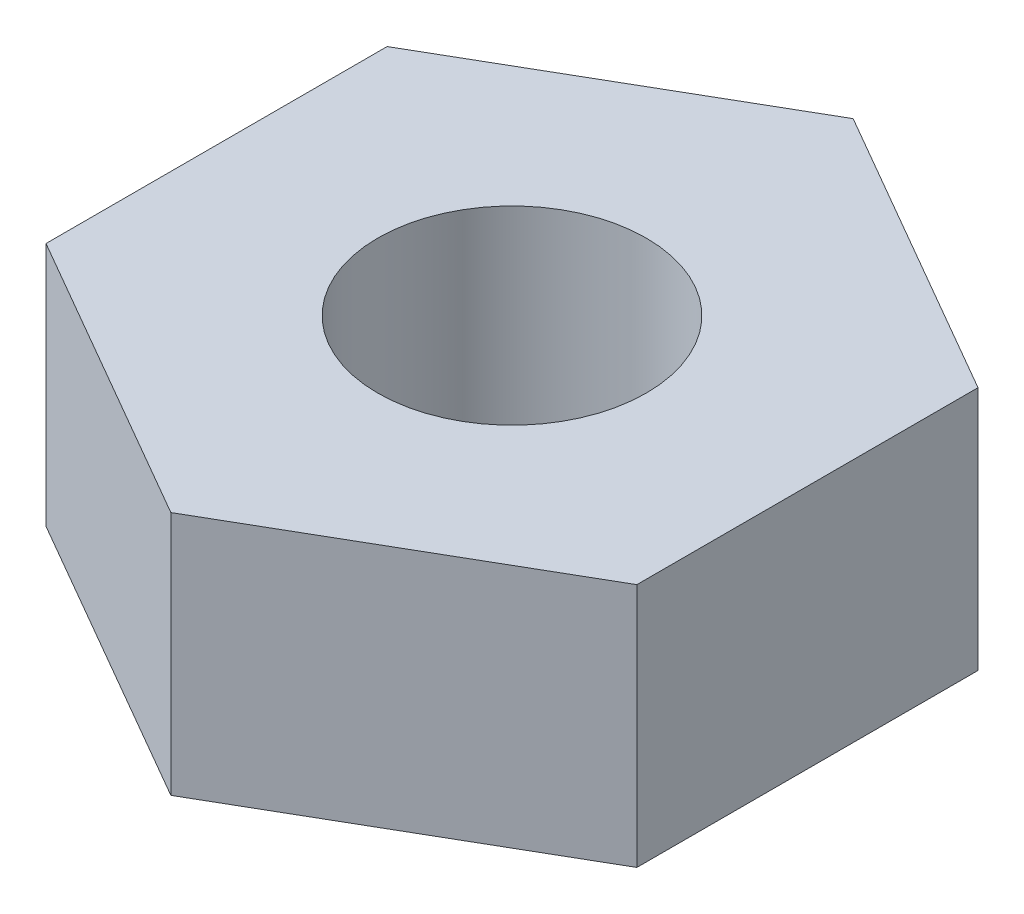
ISO-10303-21;
HEADER;
FILE_DESCRIPTION(('STEP AP214'),'2;1');
FILE_NAME('part.step','',(''),(''),'','','');
FILE_SCHEMA(('AUTOMOTIVE_DESIGN { 1 0 10303 214 1 1 1 1 }'));
ENDSEC;
DATA;
#1=APPLICATION_CONTEXT('core data for automotive mechanical design processes');
#2=APPLICATION_PROTOCOL_DEFINITION('international standard','automotive_design',2000,#1);
#3=PRODUCT_CONTEXT('',#1,'mechanical');
#4=PRODUCT('Part','Part','',(#3));
#5=PRODUCT_RELATED_PRODUCT_CATEGORY('part','',(#4));
#6=PRODUCT_DEFINITION_FORMATION('','',#4);
#7=PRODUCT_DEFINITION_CONTEXT('part definition',#1,'design');
#8=PRODUCT_DEFINITION('design','',#6,#7);
#9=PRODUCT_DEFINITION_SHAPE('','',#8);
#10=(LENGTH_UNIT() NAMED_UNIT(*) SI_UNIT(.MILLI.,.METRE.));
#11=(NAMED_UNIT(*) PLANE_ANGLE_UNIT() SI_UNIT($,.RADIAN.));
#12=(NAMED_UNIT(*) SI_UNIT($,.STERADIAN.) SOLID_ANGLE_UNIT());
#13=UNCERTAINTY_MEASURE_WITH_UNIT(LENGTH_MEASURE(1.E-05),#10,'distance_accuracy_value','');
#14=(GEOMETRIC_REPRESENTATION_CONTEXT(3) GLOBAL_UNCERTAINTY_ASSIGNED_CONTEXT((#13)) GLOBAL_UNIT_ASSIGNED_CONTEXT((#10,
#11,#12)) REPRESENTATION_CONTEXT('',''));
#15=CARTESIAN_POINT('',(0.,0.,0.));
#16=DIRECTION('',(0.,0.,1.));
#17=DIRECTION('',(1.,0.,0.));
#18=AXIS2_PLACEMENT_3D('',#15,#16,#17);
#19=CARTESIAN_POINT('',(0.,2.28,0.));
#20=DIRECTION('',(0.,1.,0.));
#21=DIRECTION('',(0.,0.,1.));
#22=AXIS2_PLACEMENT_3D('',#19,#20,#21);
#23=PLANE('',#22);
#24=DIRECTION('',(0.866025403784439,0.,0.5));
#25=VECTOR('',#24,1.);
#26=CARTESIAN_POINT('',(-2.75,2.28,1.58771324027147));
#27=LINE('',#26,#25);
#28=CARTESIAN_POINT('',(-2.75,2.28,1.58771324027147));
#29=VERTEX_POINT('',#28);
#30=CARTESIAN_POINT('',(0.,2.28,3.17542648054294));
#31=VERTEX_POINT('',#30);
#32=EDGE_CURVE('E130',#29,#31,#27,.T.);
#33=ORIENTED_EDGE('',*,*,#32,.T.);
#34=DIRECTION('',(0.866025403784438,0.,-0.5));
#35=VECTOR('',#34,1.);
#36=CARTESIAN_POINT('',(0.,2.28,3.17542648054294));
#37=LINE('',#36,#35);
#38=CARTESIAN_POINT('',(2.75,2.28,1.58771324027147));
#39=VERTEX_POINT('',#38);
#40=EDGE_CURVE('E88',#31,#39,#37,.T.);
#41=ORIENTED_EDGE('',*,*,#40,.T.);
#42=DIRECTION('',(0.,0.,-1.));
#43=VECTOR('',#42,1.);
#44=CARTESIAN_POINT('',(2.75,2.28,1.58771324027147));
#45=LINE('',#44,#43);
#46=CARTESIAN_POINT('',(2.75,2.28,-1.58771324027147));
#47=VERTEX_POINT('',#46);
#48=EDGE_CURVE('E101',#39,#47,#45,.T.);
#49=ORIENTED_EDGE('',*,*,#48,.T.);
#50=DIRECTION('',(-0.866025403784439,0.,-0.5));
#51=VECTOR('',#50,1.);
#52=CARTESIAN_POINT('',(2.75,2.28,-1.58771324027147));
#53=LINE('',#52,#51);
#54=CARTESIAN_POINT('',(0.,2.28,-3.17542648054294));
#55=VERTEX_POINT('',#54);
#56=EDGE_CURVE('E95',#47,#55,#53,.T.);
#57=ORIENTED_EDGE('',*,*,#56,.T.);
#58=DIRECTION('',(-0.866025403784439,0.,0.5));
#59=VECTOR('',#58,1.);
#60=CARTESIAN_POINT('',(0.,2.28,-3.17542648054294));
#61=LINE('',#60,#59);
#62=CARTESIAN_POINT('',(-2.75,2.28,-1.58771324027147));
#63=VERTEX_POINT('',#62);
#64=EDGE_CURVE('E99',#55,#63,#61,.T.);
#65=ORIENTED_EDGE('',*,*,#64,.T.);
#66=DIRECTION('',(0.,0.,1.));
#67=VECTOR('',#66,1.);
#68=CARTESIAN_POINT('',(-2.75,2.28,-1.58771324027147));
#69=LINE('',#68,#67);
#70=EDGE_CURVE('E51',#63,#29,#69,.T.);
#71=ORIENTED_EDGE('',*,*,#70,.T.);
#72=EDGE_LOOP('',(#33,#41,#49,#57,#65,#71));
#73=FACE_BOUND('',#72,.T.);
#74=CARTESIAN_POINT('',(0.,2.28,0.));
#75=DIRECTION('',(0.,1.,0.));
#76=DIRECTION('',(0.,0.,1.));
#77=AXIS2_PLACEMENT_3D('',#74,#75,#76);
#78=CIRCLE('',#77,1.25);
#79=CARTESIAN_POINT('',(0.,2.28,1.25));
#80=VERTEX_POINT('',#79);
#81=EDGE_CURVE('E123',#80,#80,#78,.T.);
#82=ORIENTED_EDGE('',*,*,#81,.F.);
#83=EDGE_LOOP('',(#82));
#84=FACE_BOUND('',#83,.T.);
#85=ADVANCED_FACE('F34',(#73,#84),#23,.T.);
#86=CARTESIAN_POINT('',(0.,0.,0.));
#87=DIRECTION('',(0.,1.,0.));
#88=DIRECTION('',(0.,0.,1.));
#89=AXIS2_PLACEMENT_3D('',#86,#87,#88);
#90=PLANE('',#89);
#91=DIRECTION('',(0.866025403784439,0.,0.5));
#92=VECTOR('',#91,1.);
#93=CARTESIAN_POINT('',(-2.75,0.,1.58771324027147));
#94=LINE('',#93,#92);
#95=CARTESIAN_POINT('',(-2.75,0.,1.58771324027147));
#96=VERTEX_POINT('',#95);
#97=CARTESIAN_POINT('',(0.,0.,3.17542648054294));
#98=VERTEX_POINT('',#97);
#99=EDGE_CURVE('E119',#96,#98,#94,.T.);
#100=ORIENTED_EDGE('',*,*,#99,.F.);
#101=DIRECTION('',(0.,0.,1.));
#102=VECTOR('',#101,1.);
#103=CARTESIAN_POINT('',(-2.75,0.,-1.58771324027147));
#104=LINE('',#103,#102);
#105=CARTESIAN_POINT('',(-2.75,0.,-1.58771324027147));
#106=VERTEX_POINT('',#105);
#107=EDGE_CURVE('E80',#106,#96,#104,.T.);
#108=ORIENTED_EDGE('',*,*,#107,.F.);
#109=DIRECTION('',(-0.866025403784439,0.,0.5));
#110=VECTOR('',#109,1.);
#111=CARTESIAN_POINT('',(0.,0.,-3.17542648054294));
#112=LINE('',#111,#110);
#113=CARTESIAN_POINT('',(0.,0.,-3.17542648054294));
#114=VERTEX_POINT('',#113);
#115=EDGE_CURVE('E74',#114,#106,#112,.T.);
#116=ORIENTED_EDGE('',*,*,#115,.F.);
#117=DIRECTION('',(-0.866025403784439,0.,-0.5));
#118=VECTOR('',#117,1.);
#119=CARTESIAN_POINT('',(2.75,0.,-1.58771324027147));
#120=LINE('',#119,#118);
#121=CARTESIAN_POINT('',(2.75,0.,-1.58771324027147));
#122=VERTEX_POINT('',#121);
#123=EDGE_CURVE('E109',#122,#114,#120,.T.);
#124=ORIENTED_EDGE('',*,*,#123,.F.);
#125=DIRECTION('',(0.,0.,-1.));
#126=VECTOR('',#125,1.);
#127=CARTESIAN_POINT('',(2.75,0.,1.58771324027147));
#128=LINE('',#127,#126);
#129=CARTESIAN_POINT('',(2.75,0.,1.58771324027147));
#130=VERTEX_POINT('',#129);
#131=EDGE_CURVE('E125',#130,#122,#128,.T.);
#132=ORIENTED_EDGE('',*,*,#131,.F.);
#133=DIRECTION('',(0.866025403784438,0.,-0.5));
#134=VECTOR('',#133,1.);
#135=CARTESIAN_POINT('',(0.,0.,3.17542648054294));
#136=LINE('',#135,#134);
#137=EDGE_CURVE('E122',#98,#130,#136,.T.);
#138=ORIENTED_EDGE('',*,*,#137,.F.);
#139=EDGE_LOOP('',(#100,#108,#116,#124,#132,#138));
#140=FACE_BOUND('',#139,.T.);
#141=CARTESIAN_POINT('',(0.,0.,0.));
#142=DIRECTION('',(0.,1.,0.));
#143=DIRECTION('',(0.,0.,1.));
#144=AXIS2_PLACEMENT_3D('',#141,#142,#143);
#145=CIRCLE('',#144,1.25);
#146=CARTESIAN_POINT('',(0.,0.,1.25));
#147=VERTEX_POINT('',#146);
#148=EDGE_CURVE('E223',#147,#147,#145,.T.);
#149=ORIENTED_EDGE('',*,*,#148,.T.);
#150=EDGE_LOOP('',(#149));
#151=FACE_BOUND('',#150,.T.);
#152=ADVANCED_FACE('F139',(#140,#151),#90,.F.);
#153=CARTESIAN_POINT('',(-2.75,2.28,1.58771324027147));
#154=DIRECTION('',(0.5,0.,-0.866025403784438));
#155=DIRECTION('',(-0.866025403784439,0.,-0.5));
#156=AXIS2_PLACEMENT_3D('',#153,#154,#155);
#157=PLANE('',#156);
#158=ORIENTED_EDGE('',*,*,#99,.T.);
#159=DIRECTION('',(0.,-1.,0.));
#160=VECTOR('',#159,1.);
#161=CARTESIAN_POINT('',(0.,2.28,3.17542648054294));
#162=LINE('',#161,#160);
#163=EDGE_CURVE('E11',#31,#98,#162,.T.);
#164=ORIENTED_EDGE('',*,*,#163,.F.);
#165=ORIENTED_EDGE('',*,*,#32,.F.);
#166=DIRECTION('',(0.,-1.,0.));
#167=VECTOR('',#166,1.);
#168=CARTESIAN_POINT('',(-2.75,2.28,1.58771324027147));
#169=LINE('',#168,#167);
#170=EDGE_CURVE('E115',#29,#96,#169,.T.);
#171=ORIENTED_EDGE('',*,*,#170,.T.);
#172=EDGE_LOOP('',(#158,#164,#165,#171));
#173=FACE_BOUND('',#172,.T.);
#174=ADVANCED_FACE('F36',(#173),#157,.F.);
#175=CARTESIAN_POINT('',(0.,2.28,3.17542648054294));
#176=DIRECTION('',(-0.5,0.,-0.866025403784438));
#177=DIRECTION('',(-0.866025403784439,0.,0.5));
#178=AXIS2_PLACEMENT_3D('',#175,#176,#177);
#179=PLANE('',#178);
#180=ORIENTED_EDGE('',*,*,#137,.T.);
#181=DIRECTION('',(0.,-1.,0.));
#182=VECTOR('',#181,1.);
#183=CARTESIAN_POINT('',(2.75,2.28,1.58771324027147));
#184=LINE('',#183,#182);
#185=EDGE_CURVE('E43',#39,#130,#184,.T.);
#186=ORIENTED_EDGE('',*,*,#185,.F.);
#187=ORIENTED_EDGE('',*,*,#40,.F.);
#188=ORIENTED_EDGE('',*,*,#163,.T.);
#189=EDGE_LOOP('',(#180,#186,#187,#188));
#190=FACE_BOUND('',#189,.T.);
#191=ADVANCED_FACE('F164',(#190),#179,.F.);
#192=CARTESIAN_POINT('',(2.75,2.28,1.58771324027147));
#193=DIRECTION('',(-1.,0.,0.));
#194=DIRECTION('',(0.,0.,1.));
#195=AXIS2_PLACEMENT_3D('',#192,#193,#194);
#196=PLANE('',#195);
#197=ORIENTED_EDGE('',*,*,#131,.T.);
#198=DIRECTION('',(0.,-1.,0.));
#199=VECTOR('',#198,1.);
#200=CARTESIAN_POINT('',(2.75,2.28,-1.58771324027147));
#201=LINE('',#200,#199);
#202=EDGE_CURVE('E110',#47,#122,#201,.T.);
#203=ORIENTED_EDGE('',*,*,#202,.F.);
#204=ORIENTED_EDGE('',*,*,#48,.F.);
#205=ORIENTED_EDGE('',*,*,#185,.T.);
#206=EDGE_LOOP('',(#197,#203,#204,#205));
#207=FACE_BOUND('',#206,.T.);
#208=ADVANCED_FACE('F136',(#207),#196,.F.);
#209=CARTESIAN_POINT('',(2.75,2.28,-1.58771324027147));
#210=DIRECTION('',(-0.5,0.,0.866025403784438));
#211=DIRECTION('',(0.866025403784439,0.,0.5));
#212=AXIS2_PLACEMENT_3D('',#209,#210,#211);
#213=PLANE('',#212);
#214=ORIENTED_EDGE('',*,*,#123,.T.);
#215=DIRECTION('',(0.,-1.,0.));
#216=VECTOR('',#215,1.);
#217=CARTESIAN_POINT('',(0.,2.28,-3.17542648054294));
#218=LINE('',#217,#216);
#219=EDGE_CURVE('E106',#55,#114,#218,.T.);
#220=ORIENTED_EDGE('',*,*,#219,.F.);
#221=ORIENTED_EDGE('',*,*,#56,.F.);
#222=ORIENTED_EDGE('',*,*,#202,.T.);
#223=EDGE_LOOP('',(#214,#220,#221,#222));
#224=FACE_BOUND('',#223,.T.);
#225=ADVANCED_FACE('F107',(#224),#213,.F.);
#226=CARTESIAN_POINT('',(0.,2.28,-3.17542648054294));
#227=DIRECTION('',(0.5,0.,0.866025403784439));
#228=DIRECTION('',(0.866025403784439,0.,-0.5));
#229=AXIS2_PLACEMENT_3D('',#226,#227,#228);
#230=PLANE('',#229);
#231=ORIENTED_EDGE('',*,*,#115,.T.);
#232=DIRECTION('',(0.,-1.,0.));
#233=VECTOR('',#232,1.);
#234=CARTESIAN_POINT('',(-2.75,2.28,-1.58771324027147));
#235=LINE('',#234,#233);
#236=EDGE_CURVE('E111',#63,#106,#235,.T.);
#237=ORIENTED_EDGE('',*,*,#236,.F.);
#238=ORIENTED_EDGE('',*,*,#64,.F.);
#239=ORIENTED_EDGE('',*,*,#219,.T.);
#240=EDGE_LOOP('',(#231,#237,#238,#239));
#241=FACE_BOUND('',#240,.T.);
#242=ADVANCED_FACE('F113',(#241),#230,.F.);
#243=CARTESIAN_POINT('',(-2.75,2.28,-1.58771324027147));
#244=DIRECTION('',(1.,0.,0.));
#245=DIRECTION('',(0.,0.,-1.));
#246=AXIS2_PLACEMENT_3D('',#243,#244,#245);
#247=PLANE('',#246);
#248=ORIENTED_EDGE('',*,*,#107,.T.);
#249=ORIENTED_EDGE('',*,*,#170,.F.);
#250=ORIENTED_EDGE('',*,*,#70,.F.);
#251=ORIENTED_EDGE('',*,*,#236,.T.);
#252=EDGE_LOOP('',(#248,#249,#250,#251));
#253=FACE_BOUND('',#252,.T.);
#254=ADVANCED_FACE('F144',(#253),#247,.F.);
#255=CARTESIAN_POINT('',(0.,2.28,0.));
#256=DIRECTION('',(0.,-1.,0.));
#257=DIRECTION('',(0.,0.,-1.));
#258=AXIS2_PLACEMENT_3D('',#255,#256,#257);
#259=CYLINDRICAL_SURFACE('',#258,1.25);
#260=ORIENTED_EDGE('',*,*,#81,.T.);
#261=EDGE_LOOP('',(#260));
#262=FACE_BOUND('',#261,.T.);
#263=ORIENTED_EDGE('',*,*,#148,.F.);
#264=EDGE_LOOP('',(#263));
#265=FACE_BOUND('',#264,.T.);
#266=ADVANCED_FACE('F146',(#262,#265),#259,.F.);
#267=CLOSED_SHELL('',(#85,#152,#174,#191,#208,#225,#242,#254,#266));
#268=MANIFOLD_SOLID_BREP('B2',#267);
#269=ADVANCED_BREP_SHAPE_REPRESENTATION('',(#18,#268),#14);
#270=SHAPE_DEFINITION_REPRESENTATION(#9,#269);
ENDSEC;
END-ISO-10303-21;
